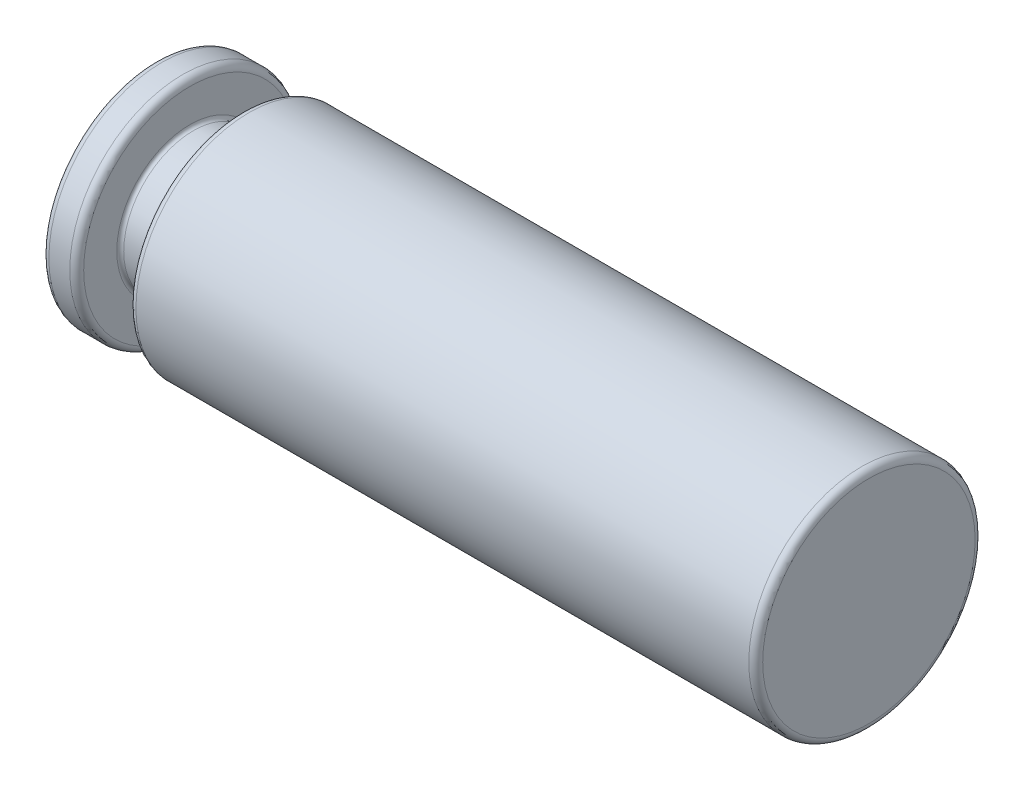
ISO-10303-21;
HEADER;
FILE_DESCRIPTION(('STEP AP214'),'2;1');
FILE_NAME('part.step','',(''),(''),'','','');
FILE_SCHEMA(('AUTOMOTIVE_DESIGN { 1 0 10303 214 1 1 1 1 }'));
ENDSEC;
DATA;
#1=APPLICATION_CONTEXT('core data for automotive mechanical design processes');
#2=APPLICATION_PROTOCOL_DEFINITION('international standard','automotive_design',2000,#1);
#3=PRODUCT_CONTEXT('',#1,'mechanical');
#4=PRODUCT('Part','Part','',(#3));
#5=PRODUCT_RELATED_PRODUCT_CATEGORY('part','',(#4));
#6=PRODUCT_DEFINITION_FORMATION('','',#4);
#7=PRODUCT_DEFINITION_CONTEXT('part definition',#1,'design');
#8=PRODUCT_DEFINITION('design','',#6,#7);
#9=PRODUCT_DEFINITION_SHAPE('','',#8);
#10=(LENGTH_UNIT() NAMED_UNIT(*) SI_UNIT(.MILLI.,.METRE.));
#11=(NAMED_UNIT(*) PLANE_ANGLE_UNIT() SI_UNIT($,.RADIAN.));
#12=(NAMED_UNIT(*) SI_UNIT($,.STERADIAN.) SOLID_ANGLE_UNIT());
#13=UNCERTAINTY_MEASURE_WITH_UNIT(LENGTH_MEASURE(1.E-05),#10,'distance_accuracy_value','');
#14=(GEOMETRIC_REPRESENTATION_CONTEXT(3) GLOBAL_UNCERTAINTY_ASSIGNED_CONTEXT((#13)) GLOBAL_UNIT_ASSIGNED_CONTEXT((#10,
#11,#12)) REPRESENTATION_CONTEXT('',''));
#15=CARTESIAN_POINT('',(0.,0.,0.));
#16=DIRECTION('',(0.,0.,1.));
#17=DIRECTION('',(1.,0.,0.));
#18=AXIS2_PLACEMENT_3D('',#15,#16,#17);
#19=CARTESIAN_POINT('',(82.,12.2,0.));
#20=DIRECTION('',(-1.,0.,0.));
#21=DIRECTION('',(0.,0.,1.));
#22=AXIS2_PLACEMENT_3D('',#19,#20,#21);
#23=PLANE('',#22);
#24=CARTESIAN_POINT('',(82.,0.,0.));
#25=DIRECTION('',(-1.,0.,0.));
#26=DIRECTION('',(0.,0.,1.));
#27=AXIS2_PLACEMENT_3D('',#24,#25,#26);
#28=CIRCLE('',#27,12.2);
#29=CARTESIAN_POINT('',(82.,0.,12.2));
#30=VERTEX_POINT('',#29);
#31=EDGE_CURVE('E10',#30,#30,#28,.T.);
#32=ORIENTED_EDGE('',*,*,#31,.F.);
#33=EDGE_LOOP('',(#32));
#34=FACE_BOUND('',#33,.T.);
#35=ADVANCED_FACE('F39',(#34),#23,.F.);
#36=CARTESIAN_POINT('',(81.2,0.,0.));
#37=DIRECTION('',(-1.,0.,0.));
#38=DIRECTION('',(0.,0.,1.));
#39=AXIS2_PLACEMENT_3D('',#36,#37,#38);
#40=TOROIDAL_SURFACE('',#39,12.2,0.799999999999999);
#41=CARTESIAN_POINT('',(81.2,0.,0.));
#42=DIRECTION('',(-1.,0.,0.));
#43=DIRECTION('',(0.,0.,1.));
#44=AXIS2_PLACEMENT_3D('',#41,#42,#43);
#45=CIRCLE('',#44,13.);
#46=CARTESIAN_POINT('',(81.2,0.,13.));
#47=VERTEX_POINT('',#46);
#48=EDGE_CURVE('E45',#47,#47,#45,.T.);
#49=ORIENTED_EDGE('',*,*,#48,.F.);
#50=EDGE_LOOP('',(#49));
#51=FACE_BOUND('',#50,.T.);
#52=ORIENTED_EDGE('',*,*,#31,.T.);
#53=EDGE_LOOP('',(#52));
#54=FACE_BOUND('',#53,.T.);
#55=ADVANCED_FACE('F141',(#51,#54),#40,.T.);
#56=CARTESIAN_POINT('',(0.,0.,0.));
#57=DIRECTION('',(-1.,0.,0.));
#58=DIRECTION('',(0.,0.,1.));
#59=AXIS2_PLACEMENT_3D('',#56,#57,#58);
#60=CYLINDRICAL_SURFACE('',#59,13.);
#61=CARTESIAN_POINT('',(10.8,0.,0.));
#62=DIRECTION('',(-1.,0.,0.));
#63=DIRECTION('',(0.,0.,1.));
#64=AXIS2_PLACEMENT_3D('',#61,#62,#63);
#65=CIRCLE('',#64,13.);
#66=CARTESIAN_POINT('',(10.8,0.,13.));
#67=VERTEX_POINT('',#66);
#68=EDGE_CURVE('E49',#67,#67,#65,.T.);
#69=ORIENTED_EDGE('',*,*,#68,.F.);
#70=EDGE_LOOP('',(#69));
#71=FACE_BOUND('',#70,.T.);
#72=ORIENTED_EDGE('',*,*,#48,.T.);
#73=EDGE_LOOP('',(#72));
#74=FACE_BOUND('',#73,.T.);
#75=ADVANCED_FACE('F136',(#71,#74),#60,.T.);
#76=CARTESIAN_POINT('',(10.8,0.,0.));
#77=DIRECTION('',(-1.,0.,0.));
#78=DIRECTION('',(0.,0.,1.));
#79=AXIS2_PLACEMENT_3D('',#76,#77,#78);
#80=TOROIDAL_SURFACE('',#79,12.2,0.8);
#81=CARTESIAN_POINT('',(10.,0.,0.));
#82=DIRECTION('',(-1.,0.,0.));
#83=DIRECTION('',(0.,0.,1.));
#84=AXIS2_PLACEMENT_3D('',#81,#82,#83);
#85=CIRCLE('',#84,12.2);
#86=CARTESIAN_POINT('',(10.,0.,12.2));
#87=VERTEX_POINT('',#86);
#88=EDGE_CURVE('E53',#87,#87,#85,.T.);
#89=ORIENTED_EDGE('',*,*,#88,.F.);
#90=EDGE_LOOP('',(#89));
#91=FACE_BOUND('',#90,.T.);
#92=ORIENTED_EDGE('',*,*,#68,.T.);
#93=EDGE_LOOP('',(#92));
#94=FACE_BOUND('',#93,.T.);
#95=ADVANCED_FACE('F130',(#91,#94),#80,.T.);
#96=CARTESIAN_POINT('',(10.,8.4,0.));
#97=DIRECTION('',(1.,0.,0.));
#98=DIRECTION('',(0.,0.,-1.));
#99=AXIS2_PLACEMENT_3D('',#96,#97,#98);
#100=PLANE('',#99);
#101=CARTESIAN_POINT('',(10.,0.,0.));
#102=DIRECTION('',(-1.,0.,0.));
#103=DIRECTION('',(0.,0.,1.));
#104=AXIS2_PLACEMENT_3D('',#101,#102,#103);
#105=CIRCLE('',#104,8.4);
#106=CARTESIAN_POINT('',(10.,0.,8.4));
#107=VERTEX_POINT('',#106);
#108=EDGE_CURVE('E58',#107,#107,#105,.T.);
#109=ORIENTED_EDGE('',*,*,#108,.F.);
#110=EDGE_LOOP('',(#109));
#111=FACE_BOUND('',#110,.T.);
#112=ORIENTED_EDGE('',*,*,#88,.T.);
#113=EDGE_LOOP('',(#112));
#114=FACE_BOUND('',#113,.T.);
#115=ADVANCED_FACE('F124',(#111,#114),#100,.F.);
#116=CARTESIAN_POINT('',(9.60000000000001,0.,0.));
#117=DIRECTION('',(-1.,0.,0.));
#118=DIRECTION('',(0.,0.,1.));
#119=AXIS2_PLACEMENT_3D('',#116,#117,#118);
#120=TOROIDAL_SURFACE('',#119,8.4,0.399999999999999);
#121=CARTESIAN_POINT('',(9.60000000000001,0.,0.));
#122=DIRECTION('',(-1.,0.,0.));
#123=DIRECTION('',(0.,0.,1.));
#124=AXIS2_PLACEMENT_3D('',#121,#122,#123);
#125=CIRCLE('',#124,8.);
#126=CARTESIAN_POINT('',(9.60000000000001,0.,8.));
#127=VERTEX_POINT('',#126);
#128=EDGE_CURVE('E61',#127,#127,#125,.T.);
#129=ORIENTED_EDGE('',*,*,#128,.F.);
#130=EDGE_LOOP('',(#129));
#131=FACE_BOUND('',#130,.T.);
#132=ORIENTED_EDGE('',*,*,#108,.T.);
#133=EDGE_LOOP('',(#132));
#134=FACE_BOUND('',#133,.T.);
#135=ADVANCED_FACE('F118',(#131,#134),#120,.F.);
#136=CARTESIAN_POINT('',(0.,0.,0.));
#137=DIRECTION('',(-1.,0.,0.));
#138=DIRECTION('',(0.,0.,1.));
#139=AXIS2_PLACEMENT_3D('',#136,#137,#138);
#140=CYLINDRICAL_SURFACE('',#139,8.);
#141=CARTESIAN_POINT('',(4.40000000000001,0.,0.));
#142=DIRECTION('',(-1.,0.,0.));
#143=DIRECTION('',(0.,0.,1.));
#144=AXIS2_PLACEMENT_3D('',#141,#142,#143);
#145=CIRCLE('',#144,8.);
#146=CARTESIAN_POINT('',(4.40000000000001,0.,8.));
#147=VERTEX_POINT('',#146);
#148=EDGE_CURVE('E64',#147,#147,#145,.T.);
#149=ORIENTED_EDGE('',*,*,#148,.F.);
#150=EDGE_LOOP('',(#149));
#151=FACE_BOUND('',#150,.T.);
#152=ORIENTED_EDGE('',*,*,#128,.T.);
#153=EDGE_LOOP('',(#152));
#154=FACE_BOUND('',#153,.T.);
#155=ADVANCED_FACE('F112',(#151,#154),#140,.T.);
#156=CARTESIAN_POINT('',(4.40000000000001,0.,0.));
#157=DIRECTION('',(-1.,0.,0.));
#158=DIRECTION('',(0.,0.,1.));
#159=AXIS2_PLACEMENT_3D('',#156,#157,#158);
#160=TOROIDAL_SURFACE('',#159,8.4,0.400000000000001);
#161=CARTESIAN_POINT('',(4.00000000000001,0.,0.));
#162=DIRECTION('',(-1.,0.,0.));
#163=DIRECTION('',(0.,0.,1.));
#164=AXIS2_PLACEMENT_3D('',#161,#162,#163);
#165=CIRCLE('',#164,8.4);
#166=CARTESIAN_POINT('',(4.00000000000001,0.,8.4));
#167=VERTEX_POINT('',#166);
#168=EDGE_CURVE('E67',#167,#167,#165,.T.);
#169=ORIENTED_EDGE('',*,*,#168,.F.);
#170=EDGE_LOOP('',(#169));
#171=FACE_BOUND('',#170,.T.);
#172=ORIENTED_EDGE('',*,*,#148,.T.);
#173=EDGE_LOOP('',(#172));
#174=FACE_BOUND('',#173,.T.);
#175=ADVANCED_FACE('F106',(#171,#174),#160,.F.);
#176=CARTESIAN_POINT('',(4.00000000000001,12.2,0.));
#177=DIRECTION('',(-1.,0.,0.));
#178=DIRECTION('',(0.,0.,1.));
#179=AXIS2_PLACEMENT_3D('',#176,#177,#178);
#180=PLANE('',#179);
#181=CARTESIAN_POINT('',(4.00000000000001,0.,0.));
#182=DIRECTION('',(-1.,0.,0.));
#183=DIRECTION('',(0.,0.,1.));
#184=AXIS2_PLACEMENT_3D('',#181,#182,#183);
#185=CIRCLE('',#184,12.2);
#186=CARTESIAN_POINT('',(4.00000000000001,0.,12.2));
#187=VERTEX_POINT('',#186);
#188=EDGE_CURVE('E70',#187,#187,#185,.T.);
#189=ORIENTED_EDGE('',*,*,#188,.F.);
#190=EDGE_LOOP('',(#189));
#191=FACE_BOUND('',#190,.T.);
#192=ORIENTED_EDGE('',*,*,#168,.T.);
#193=EDGE_LOOP('',(#192));
#194=FACE_BOUND('',#193,.T.);
#195=ADVANCED_FACE('F100',(#191,#194),#180,.F.);
#196=CARTESIAN_POINT('',(3.20000000000001,0.,0.));
#197=DIRECTION('',(-1.,0.,0.));
#198=DIRECTION('',(0.,0.,1.));
#199=AXIS2_PLACEMENT_3D('',#196,#197,#198);
#200=TOROIDAL_SURFACE('',#199,12.2,0.800000000000001);
#201=CARTESIAN_POINT('',(3.20000000000001,0.,0.));
#202=DIRECTION('',(-1.,0.,0.));
#203=DIRECTION('',(0.,0.,1.));
#204=AXIS2_PLACEMENT_3D('',#201,#202,#203);
#205=CIRCLE('',#204,13.);
#206=CARTESIAN_POINT('',(3.20000000000001,0.,13.));
#207=VERTEX_POINT('',#206);
#208=EDGE_CURVE('E73',#207,#207,#205,.T.);
#209=ORIENTED_EDGE('',*,*,#208,.F.);
#210=EDGE_LOOP('',(#209));
#211=FACE_BOUND('',#210,.T.);
#212=ORIENTED_EDGE('',*,*,#188,.T.);
#213=EDGE_LOOP('',(#212));
#214=FACE_BOUND('',#213,.T.);
#215=ADVANCED_FACE('F94',(#211,#214),#200,.T.);
#216=CARTESIAN_POINT('',(0.,0.,0.));
#217=DIRECTION('',(-1.,0.,0.));
#218=DIRECTION('',(0.,0.,1.));
#219=AXIS2_PLACEMENT_3D('',#216,#217,#218);
#220=CYLINDRICAL_SURFACE('',#219,13.);
#221=CARTESIAN_POINT('',(0.8,0.,0.));
#222=DIRECTION('',(-1.,0.,0.));
#223=DIRECTION('',(0.,0.,1.));
#224=AXIS2_PLACEMENT_3D('',#221,#222,#223);
#225=CIRCLE('',#224,13.);
#226=CARTESIAN_POINT('',(0.8,0.,13.));
#227=VERTEX_POINT('',#226);
#228=EDGE_CURVE('E76',#227,#227,#225,.T.);
#229=ORIENTED_EDGE('',*,*,#228,.F.);
#230=EDGE_LOOP('',(#229));
#231=FACE_BOUND('',#230,.T.);
#232=ORIENTED_EDGE('',*,*,#208,.T.);
#233=EDGE_LOOP('',(#232));
#234=FACE_BOUND('',#233,.T.);
#235=ADVANCED_FACE('F88',(#231,#234),#220,.T.);
#236=CARTESIAN_POINT('',(0.8,0.,0.));
#237=DIRECTION('',(-1.,0.,0.));
#238=DIRECTION('',(0.,0.,1.));
#239=AXIS2_PLACEMENT_3D('',#236,#237,#238);
#240=TOROIDAL_SURFACE('',#239,12.2,0.800000000000001);
#241=CARTESIAN_POINT('',(0.,0.,0.));
#242=DIRECTION('',(-1.,0.,0.));
#243=DIRECTION('',(0.,0.,1.));
#244=AXIS2_PLACEMENT_3D('',#241,#242,#243);
#245=CIRCLE('',#244,12.2);
#246=CARTESIAN_POINT('',(0.,0.,12.2));
#247=VERTEX_POINT('',#246);
#248=EDGE_CURVE('E79',#247,#247,#245,.T.);
#249=ORIENTED_EDGE('',*,*,#248,.F.);
#250=EDGE_LOOP('',(#249));
#251=FACE_BOUND('',#250,.T.);
#252=ORIENTED_EDGE('',*,*,#228,.T.);
#253=EDGE_LOOP('',(#252));
#254=FACE_BOUND('',#253,.T.);
#255=ADVANCED_FACE('F85',(#251,#254),#240,.T.);
#256=CARTESIAN_POINT('',(0.,0.,0.));
#257=DIRECTION('',(1.,0.,0.));
#258=DIRECTION('',(0.,0.,-1.));
#259=AXIS2_PLACEMENT_3D('',#256,#257,#258);
#260=PLANE('',#259);
#261=ORIENTED_EDGE('',*,*,#248,.T.);
#262=EDGE_LOOP('',(#261));
#263=FACE_BOUND('',#262,.T.);
#264=ADVANCED_FACE('F83',(#263),#260,.F.);
#265=CLOSED_SHELL('',(#35,#55,#75,#95,#115,#135,#155,#175,#195,#215,#235,#255,#264));
#266=MANIFOLD_SOLID_BREP('B2',#265);
#267=ADVANCED_BREP_SHAPE_REPRESENTATION('',(#18,#266),#14);
#268=SHAPE_DEFINITION_REPRESENTATION(#9,#267);
ENDSEC;
END-ISO-10303-21;
